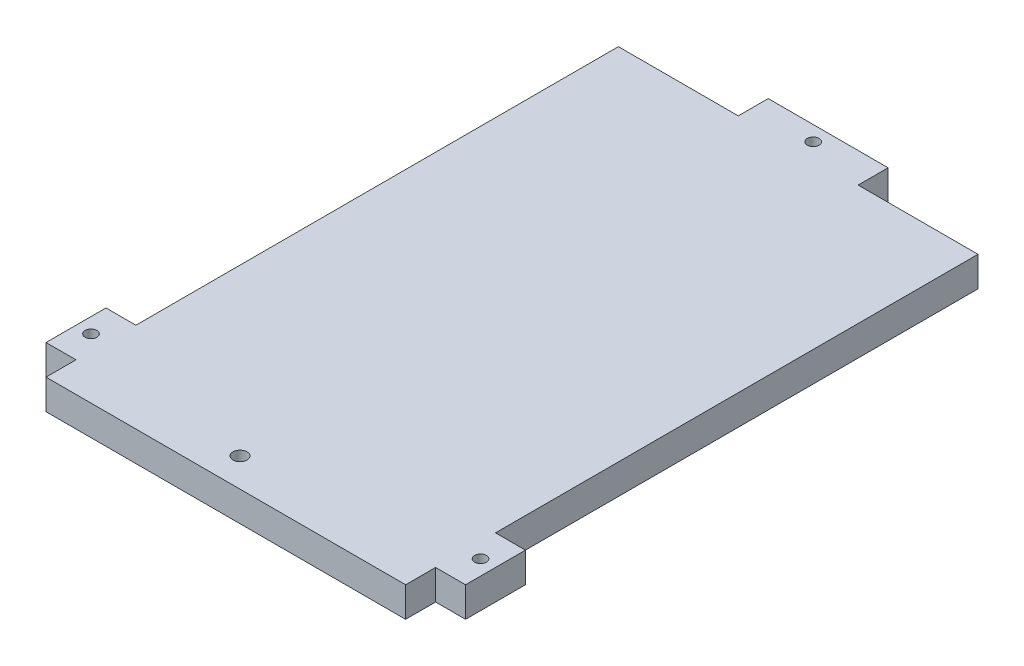
ISO-10303-21;
HEADER;
FILE_DESCRIPTION(('STEP AP214'),'2;1');
FILE_NAME('part.step','',(''),(''),'','','');
FILE_SCHEMA(('AUTOMOTIVE_DESIGN { 1 0 10303 214 1 1 1 1 }'));
ENDSEC;
DATA;
#1=APPLICATION_CONTEXT('core data for automotive mechanical design processes');
#2=APPLICATION_PROTOCOL_DEFINITION('international standard','automotive_design',2000,#1);
#3=PRODUCT_CONTEXT('',#1,'mechanical');
#4=PRODUCT('Part','Part','',(#3));
#5=PRODUCT_RELATED_PRODUCT_CATEGORY('part','',(#4));
#6=PRODUCT_DEFINITION_FORMATION('','',#4);
#7=PRODUCT_DEFINITION_CONTEXT('part definition',#1,'design');
#8=PRODUCT_DEFINITION('design','',#6,#7);
#9=PRODUCT_DEFINITION_SHAPE('','',#8);
#10=(LENGTH_UNIT() NAMED_UNIT(*) SI_UNIT(.MILLI.,.METRE.));
#11=(NAMED_UNIT(*) PLANE_ANGLE_UNIT() SI_UNIT($,.RADIAN.));
#12=(NAMED_UNIT(*) SI_UNIT($,.STERADIAN.) SOLID_ANGLE_UNIT());
#13=UNCERTAINTY_MEASURE_WITH_UNIT(LENGTH_MEASURE(1.E-05),#10,'distance_accuracy_value','');
#14=(GEOMETRIC_REPRESENTATION_CONTEXT(3) GLOBAL_UNCERTAINTY_ASSIGNED_CONTEXT((#13)) GLOBAL_UNIT_ASSIGNED_CONTEXT((#10,
#11,#12)) REPRESENTATION_CONTEXT('',''));
#15=CARTESIAN_POINT('',(0.,0.,0.));
#16=DIRECTION('',(0.,0.,1.));
#17=DIRECTION('',(1.,0.,0.));
#18=AXIS2_PLACEMENT_3D('',#15,#16,#17);
#19=CARTESIAN_POINT('',(0.,6.35,0.));
#20=DIRECTION('',(1.,0.,0.));
#21=DIRECTION('',(0.,0.,-1.));
#22=AXIS2_PLACEMENT_3D('',#19,#20,#21);
#23=PLANE('',#22);
#24=DIRECTION('',(0.,0.,1.));
#25=VECTOR('',#24,1.);
#26=CARTESIAN_POINT('',(0.,0.,0.));
#27=LINE('',#26,#25);
#28=CARTESIAN_POINT('',(0.,0.,-6.35));
#29=VERTEX_POINT('',#28);
#30=CARTESIAN_POINT('',(0.,0.,0.));
#31=VERTEX_POINT('',#30);
#32=EDGE_CURVE('E177',#29,#31,#27,.T.);
#33=ORIENTED_EDGE('',*,*,#32,.T.);
#34=DIRECTION('',(0.,-1.,0.));
#35=VECTOR('',#34,1.);
#36=CARTESIAN_POINT('',(0.,6.35,0.));
#37=LINE('',#36,#35);
#38=CARTESIAN_POINT('',(0.,6.35,0.));
#39=VERTEX_POINT('',#38);
#40=EDGE_CURVE('E11',#39,#31,#37,.T.);
#41=ORIENTED_EDGE('',*,*,#40,.F.);
#42=DIRECTION('',(0.,0.,1.));
#43=VECTOR('',#42,1.);
#44=CARTESIAN_POINT('',(0.,6.35,0.));
#45=LINE('',#44,#43);
#46=CARTESIAN_POINT('',(0.,6.35,-6.35));
#47=VERTEX_POINT('',#46);
#48=EDGE_CURVE('E208',#47,#39,#45,.T.);
#49=ORIENTED_EDGE('',*,*,#48,.F.);
#50=DIRECTION('',(0.,-1.,0.));
#51=VECTOR('',#50,1.);
#52=CARTESIAN_POINT('',(0.,6.35,-6.35));
#53=LINE('',#52,#51);
#54=EDGE_CURVE('E173',#47,#29,#53,.T.);
#55=ORIENTED_EDGE('',*,*,#54,.T.);
#56=EDGE_LOOP('',(#33,#41,#49,#55));
#57=FACE_BOUND('',#56,.T.);
#58=ADVANCED_FACE('F33',(#57),#23,.F.);
#59=CARTESIAN_POINT('',(0.,6.35,0.));
#60=DIRECTION('',(0.,0.,-1.));
#61=DIRECTION('',(-1.,0.,0.));
#62=AXIS2_PLACEMENT_3D('',#59,#60,#61);
#63=PLANE('',#62);
#64=DIRECTION('',(1.,0.,0.));
#65=VECTOR('',#64,1.);
#66=CARTESIAN_POINT('',(0.,0.,0.));
#67=LINE('',#66,#65);
#68=CARTESIAN_POINT('',(76.2,0.,0.));
#69=VERTEX_POINT('',#68);
#70=EDGE_CURVE('E180',#31,#69,#67,.T.);
#71=ORIENTED_EDGE('',*,*,#70,.T.);
#72=DIRECTION('',(0.,-1.,0.));
#73=VECTOR('',#72,1.);
#74=CARTESIAN_POINT('',(76.2,6.35,0.));
#75=LINE('',#74,#73);
#76=CARTESIAN_POINT('',(76.2,6.35,0.));
#77=VERTEX_POINT('',#76);
#78=EDGE_CURVE('E41',#77,#69,#75,.T.);
#79=ORIENTED_EDGE('',*,*,#78,.F.);
#80=DIRECTION('',(1.,0.,0.));
#81=VECTOR('',#80,1.);
#82=CARTESIAN_POINT('',(0.,6.35,0.));
#83=LINE('',#82,#81);
#84=EDGE_CURVE('E116',#39,#77,#83,.T.);
#85=ORIENTED_EDGE('',*,*,#84,.F.);
#86=ORIENTED_EDGE('',*,*,#40,.T.);
#87=EDGE_LOOP('',(#71,#79,#85,#86));
#88=FACE_BOUND('',#87,.T.);
#89=ADVANCED_FACE('F307',(#88),#63,.F.);
#90=CARTESIAN_POINT('',(76.2,6.35,0.));
#91=DIRECTION('',(-1.,0.,0.));
#92=DIRECTION('',(0.,0.,1.));
#93=AXIS2_PLACEMENT_3D('',#90,#91,#92);
#94=PLANE('',#93);
#95=DIRECTION('',(0.,0.,-1.));
#96=VECTOR('',#95,1.);
#97=CARTESIAN_POINT('',(76.2,0.,0.));
#98=LINE('',#97,#96);
#99=CARTESIAN_POINT('',(76.2,0.,-6.35));
#100=VERTEX_POINT('',#99);
#101=EDGE_CURVE('E183',#69,#100,#98,.T.);
#102=ORIENTED_EDGE('',*,*,#101,.T.);
#103=DIRECTION('',(0.,-1.,0.));
#104=VECTOR('',#103,1.);
#105=CARTESIAN_POINT('',(76.2,6.35,-6.35));
#106=LINE('',#105,#104);
#107=CARTESIAN_POINT('',(76.2,6.35,-6.35));
#108=VERTEX_POINT('',#107);
#109=EDGE_CURVE('E239',#108,#100,#106,.T.);
#110=ORIENTED_EDGE('',*,*,#109,.F.);
#111=DIRECTION('',(0.,0.,-1.));
#112=VECTOR('',#111,1.);
#113=CARTESIAN_POINT('',(76.2,6.35,0.));
#114=LINE('',#113,#112);
#115=EDGE_CURVE('E247',#77,#108,#114,.T.);
#116=ORIENTED_EDGE('',*,*,#115,.F.);
#117=ORIENTED_EDGE('',*,*,#78,.T.);
#118=EDGE_LOOP('',(#102,#110,#116,#117));
#119=FACE_BOUND('',#118,.T.);
#120=ADVANCED_FACE('F245',(#119),#94,.F.);
#121=CARTESIAN_POINT('',(76.2,6.35,-6.35));
#122=DIRECTION('',(0.,0.,-1.));
#123=DIRECTION('',(-1.,0.,0.));
#124=AXIS2_PLACEMENT_3D('',#121,#122,#123);
#125=PLANE('',#124);
#126=DIRECTION('',(1.,0.,0.));
#127=VECTOR('',#126,1.);
#128=CARTESIAN_POINT('',(76.2,0.,-6.35));
#129=LINE('',#128,#127);
#130=CARTESIAN_POINT('',(82.55,0.,-6.35));
#131=VERTEX_POINT('',#130);
#132=EDGE_CURVE('E185',#100,#131,#129,.T.);
#133=ORIENTED_EDGE('',*,*,#132,.T.);
#134=DIRECTION('',(0.,-1.,0.));
#135=VECTOR('',#134,1.);
#136=CARTESIAN_POINT('',(82.55,6.35,-6.35));
#137=LINE('',#136,#135);
#138=CARTESIAN_POINT('',(82.55,6.35,-6.35));
#139=VERTEX_POINT('',#138);
#140=EDGE_CURVE('E236',#139,#131,#137,.T.);
#141=ORIENTED_EDGE('',*,*,#140,.F.);
#142=DIRECTION('',(1.,0.,0.));
#143=VECTOR('',#142,1.);
#144=CARTESIAN_POINT('',(76.2,6.35,-6.35));
#145=LINE('',#144,#143);
#146=EDGE_CURVE('E265',#108,#139,#145,.T.);
#147=ORIENTED_EDGE('',*,*,#146,.F.);
#148=ORIENTED_EDGE('',*,*,#109,.T.);
#149=EDGE_LOOP('',(#133,#141,#147,#148));
#150=FACE_BOUND('',#149,.T.);
#151=ADVANCED_FACE('F256',(#150),#125,.F.);
#152=CARTESIAN_POINT('',(82.55,6.35,-19.05));
#153=DIRECTION('',(-1.,0.,0.));
#154=DIRECTION('',(0.,0.,1.));
#155=AXIS2_PLACEMENT_3D('',#152,#153,#154);
#156=PLANE('',#155);
#157=DIRECTION('',(0.,0.,-1.));
#158=VECTOR('',#157,1.);
#159=CARTESIAN_POINT('',(82.55,0.,-19.05));
#160=LINE('',#159,#158);
#161=CARTESIAN_POINT('',(82.55,0.,-19.05));
#162=VERTEX_POINT('',#161);
#163=EDGE_CURVE('E187',#131,#162,#160,.T.);
#164=ORIENTED_EDGE('',*,*,#163,.T.);
#165=DIRECTION('',(0.,-1.,0.));
#166=VECTOR('',#165,1.);
#167=CARTESIAN_POINT('',(82.55,6.35,-19.05));
#168=LINE('',#167,#166);
#169=CARTESIAN_POINT('',(82.55,6.35,-19.05));
#170=VERTEX_POINT('',#169);
#171=EDGE_CURVE('E233',#170,#162,#168,.T.);
#172=ORIENTED_EDGE('',*,*,#171,.F.);
#173=DIRECTION('',(0.,0.,-1.));
#174=VECTOR('',#173,1.);
#175=CARTESIAN_POINT('',(82.55,6.35,-19.05));
#176=LINE('',#175,#174);
#177=EDGE_CURVE('E262',#139,#170,#176,.T.);
#178=ORIENTED_EDGE('',*,*,#177,.F.);
#179=ORIENTED_EDGE('',*,*,#140,.T.);
#180=EDGE_LOOP('',(#164,#172,#178,#179));
#181=FACE_BOUND('',#180,.T.);
#182=ADVANCED_FACE('F260',(#181),#156,.F.);
#183=CARTESIAN_POINT('',(76.2,6.35,-19.05));
#184=DIRECTION('',(0.,0.,1.));
#185=DIRECTION('',(1.,0.,0.));
#186=AXIS2_PLACEMENT_3D('',#183,#184,#185);
#187=PLANE('',#186);
#188=DIRECTION('',(-1.,0.,0.));
#189=VECTOR('',#188,1.);
#190=CARTESIAN_POINT('',(76.2,0.,-19.05));
#191=LINE('',#190,#189);
#192=CARTESIAN_POINT('',(76.2,0.,-19.05));
#193=VERTEX_POINT('',#192);
#194=EDGE_CURVE('E189',#162,#193,#191,.T.);
#195=ORIENTED_EDGE('',*,*,#194,.T.);
#196=DIRECTION('',(0.,-1.,0.));
#197=VECTOR('',#196,1.);
#198=CARTESIAN_POINT('',(76.2,6.35,-19.05));
#199=LINE('',#198,#197);
#200=CARTESIAN_POINT('',(76.2,6.35,-19.05));
#201=VERTEX_POINT('',#200);
#202=EDGE_CURVE('E230',#201,#193,#199,.T.);
#203=ORIENTED_EDGE('',*,*,#202,.F.);
#204=DIRECTION('',(-1.,0.,0.));
#205=VECTOR('',#204,1.);
#206=CARTESIAN_POINT('',(76.2,6.35,-19.05));
#207=LINE('',#206,#205);
#208=EDGE_CURVE('E264',#170,#201,#207,.T.);
#209=ORIENTED_EDGE('',*,*,#208,.F.);
#210=ORIENTED_EDGE('',*,*,#171,.T.);
#211=EDGE_LOOP('',(#195,#203,#209,#210));
#212=FACE_BOUND('',#211,.T.);
#213=ADVANCED_FACE('F320',(#212),#187,.F.);
#214=CARTESIAN_POINT('',(76.2,6.35,-19.05));
#215=DIRECTION('',(-1.,0.,0.));
#216=DIRECTION('',(0.,0.,1.));
#217=AXIS2_PLACEMENT_3D('',#214,#215,#216);
#218=PLANE('',#217);
#219=DIRECTION('',(0.,0.,-1.));
#220=VECTOR('',#219,1.);
#221=CARTESIAN_POINT('',(76.2,0.,-19.05));
#222=LINE('',#221,#220);
#223=CARTESIAN_POINT('',(76.2,0.,-121.285));
#224=VERTEX_POINT('',#223);
#225=EDGE_CURVE('E191',#193,#224,#222,.T.);
#226=ORIENTED_EDGE('',*,*,#225,.T.);
#227=DIRECTION('',(0.,-1.,0.));
#228=VECTOR('',#227,1.);
#229=CARTESIAN_POINT('',(76.2,6.35,-121.285));
#230=LINE('',#229,#228);
#231=CARTESIAN_POINT('',(76.2,6.35,-121.285));
#232=VERTEX_POINT('',#231);
#233=EDGE_CURVE('E227',#232,#224,#230,.T.);
#234=ORIENTED_EDGE('',*,*,#233,.F.);
#235=DIRECTION('',(0.,0.,-1.));
#236=VECTOR('',#235,1.);
#237=CARTESIAN_POINT('',(76.2,6.35,-19.05));
#238=LINE('',#237,#236);
#239=EDGE_CURVE('E267',#201,#232,#238,.T.);
#240=ORIENTED_EDGE('',*,*,#239,.F.);
#241=ORIENTED_EDGE('',*,*,#202,.T.);
#242=EDGE_LOOP('',(#226,#234,#240,#241));
#243=FACE_BOUND('',#242,.T.);
#244=ADVANCED_FACE('F323',(#243),#218,.F.);
#245=CARTESIAN_POINT('',(50.8,6.35,-121.285));
#246=DIRECTION('',(0.,0.,1.));
#247=DIRECTION('',(1.,0.,0.));
#248=AXIS2_PLACEMENT_3D('',#245,#246,#247);
#249=PLANE('',#248);
#250=DIRECTION('',(-1.,0.,0.));
#251=VECTOR('',#250,1.);
#252=CARTESIAN_POINT('',(50.8,0.,-121.285));
#253=LINE('',#252,#251);
#254=CARTESIAN_POINT('',(50.8,0.,-121.285));
#255=VERTEX_POINT('',#254);
#256=EDGE_CURVE('E193',#224,#255,#253,.T.);
#257=ORIENTED_EDGE('',*,*,#256,.T.);
#258=DIRECTION('',(0.,-1.,0.));
#259=VECTOR('',#258,1.);
#260=CARTESIAN_POINT('',(50.8,6.35,-121.285));
#261=LINE('',#260,#259);
#262=CARTESIAN_POINT('',(50.8,6.35,-121.285));
#263=VERTEX_POINT('',#262);
#264=EDGE_CURVE('E224',#263,#255,#261,.T.);
#265=ORIENTED_EDGE('',*,*,#264,.F.);
#266=DIRECTION('',(-1.,0.,0.));
#267=VECTOR('',#266,1.);
#268=CARTESIAN_POINT('',(50.8,6.35,-121.285));
#269=LINE('',#268,#267);
#270=EDGE_CURVE('E273',#232,#263,#269,.T.);
#271=ORIENTED_EDGE('',*,*,#270,.F.);
#272=ORIENTED_EDGE('',*,*,#233,.T.);
#273=EDGE_LOOP('',(#257,#265,#271,#272));
#274=FACE_BOUND('',#273,.T.);
#275=ADVANCED_FACE('F327',(#274),#249,.F.);
#276=CARTESIAN_POINT('',(50.8,6.35,-121.285));
#277=DIRECTION('',(-1.,0.,0.));
#278=DIRECTION('',(0.,0.,1.));
#279=AXIS2_PLACEMENT_3D('',#276,#277,#278);
#280=PLANE('',#279);
#281=DIRECTION('',(0.,0.,-1.));
#282=VECTOR('',#281,1.);
#283=CARTESIAN_POINT('',(50.8,0.,-121.285));
#284=LINE('',#283,#282);
#285=CARTESIAN_POINT('',(50.8,0.,-127.635));
#286=VERTEX_POINT('',#285);
#287=EDGE_CURVE('E195',#255,#286,#284,.T.);
#288=ORIENTED_EDGE('',*,*,#287,.T.);
#289=DIRECTION('',(0.,-1.,0.));
#290=VECTOR('',#289,1.);
#291=CARTESIAN_POINT('',(50.8,6.35,-127.635));
#292=LINE('',#291,#290);
#293=CARTESIAN_POINT('',(50.8,6.35,-127.635));
#294=VERTEX_POINT('',#293);
#295=EDGE_CURVE('E221',#294,#286,#292,.T.);
#296=ORIENTED_EDGE('',*,*,#295,.F.);
#297=DIRECTION('',(0.,0.,-1.));
#298=VECTOR('',#297,1.);
#299=CARTESIAN_POINT('',(50.8,6.35,-121.285));
#300=LINE('',#299,#298);
#301=EDGE_CURVE('E275',#263,#294,#300,.T.);
#302=ORIENTED_EDGE('',*,*,#301,.F.);
#303=ORIENTED_EDGE('',*,*,#264,.T.);
#304=EDGE_LOOP('',(#288,#296,#302,#303));
#305=FACE_BOUND('',#304,.T.);
#306=ADVANCED_FACE('F331',(#305),#280,.F.);
#307=CARTESIAN_POINT('',(25.4,6.35,-127.635));
#308=DIRECTION('',(0.,0.,1.));
#309=DIRECTION('',(1.,0.,0.));
#310=AXIS2_PLACEMENT_3D('',#307,#308,#309);
#311=PLANE('',#310);
#312=DIRECTION('',(-1.,0.,0.));
#313=VECTOR('',#312,1.);
#314=CARTESIAN_POINT('',(25.4,0.,-127.635));
#315=LINE('',#314,#313);
#316=CARTESIAN_POINT('',(25.4,0.,-127.635));
#317=VERTEX_POINT('',#316);
#318=EDGE_CURVE('E197',#286,#317,#315,.T.);
#319=ORIENTED_EDGE('',*,*,#318,.T.);
#320=DIRECTION('',(0.,-1.,0.));
#321=VECTOR('',#320,1.);
#322=CARTESIAN_POINT('',(25.4,6.35,-127.635));
#323=LINE('',#322,#321);
#324=CARTESIAN_POINT('',(25.4,6.35,-127.635));
#325=VERTEX_POINT('',#324);
#326=EDGE_CURVE('E218',#325,#317,#323,.T.);
#327=ORIENTED_EDGE('',*,*,#326,.F.);
#328=DIRECTION('',(-1.,0.,0.));
#329=VECTOR('',#328,1.);
#330=CARTESIAN_POINT('',(25.4,6.35,-127.635));
#331=LINE('',#330,#329);
#332=EDGE_CURVE('E277',#294,#325,#331,.T.);
#333=ORIENTED_EDGE('',*,*,#332,.F.);
#334=ORIENTED_EDGE('',*,*,#295,.T.);
#335=EDGE_LOOP('',(#319,#327,#333,#334));
#336=FACE_BOUND('',#335,.T.);
#337=ADVANCED_FACE('F335',(#336),#311,.F.);
#338=CARTESIAN_POINT('',(25.4,6.35,-121.285));
#339=DIRECTION('',(1.,0.,0.));
#340=DIRECTION('',(0.,0.,-1.));
#341=AXIS2_PLACEMENT_3D('',#338,#339,#340);
#342=PLANE('',#341);
#343=DIRECTION('',(0.,0.,1.));
#344=VECTOR('',#343,1.);
#345=CARTESIAN_POINT('',(25.4,0.,-121.285));
#346=LINE('',#345,#344);
#347=CARTESIAN_POINT('',(25.4,0.,-121.285));
#348=VERTEX_POINT('',#347);
#349=EDGE_CURVE('E199',#317,#348,#346,.T.);
#350=ORIENTED_EDGE('',*,*,#349,.T.);
#351=DIRECTION('',(0.,-1.,0.));
#352=VECTOR('',#351,1.);
#353=CARTESIAN_POINT('',(25.4,6.35,-121.285));
#354=LINE('',#353,#352);
#355=CARTESIAN_POINT('',(25.4,6.35,-121.285));
#356=VERTEX_POINT('',#355);
#357=EDGE_CURVE('E215',#356,#348,#354,.T.);
#358=ORIENTED_EDGE('',*,*,#357,.F.);
#359=DIRECTION('',(0.,0.,1.));
#360=VECTOR('',#359,1.);
#361=CARTESIAN_POINT('',(25.4,6.35,-121.285));
#362=LINE('',#361,#360);
#363=EDGE_CURVE('E279',#325,#356,#362,.T.);
#364=ORIENTED_EDGE('',*,*,#363,.F.);
#365=ORIENTED_EDGE('',*,*,#326,.T.);
#366=EDGE_LOOP('',(#350,#358,#364,#365));
#367=FACE_BOUND('',#366,.T.);
#368=ADVANCED_FACE('F339',(#367),#342,.F.);
#369=CARTESIAN_POINT('',(0.,6.35,-121.285));
#370=DIRECTION('',(0.,0.,1.));
#371=DIRECTION('',(1.,0.,0.));
#372=AXIS2_PLACEMENT_3D('',#369,#370,#371);
#373=PLANE('',#372);
#374=DIRECTION('',(-1.,0.,0.));
#375=VECTOR('',#374,1.);
#376=CARTESIAN_POINT('',(0.,0.,-121.285));
#377=LINE('',#376,#375);
#378=CARTESIAN_POINT('',(0.,0.,-121.285));
#379=VERTEX_POINT('',#378);
#380=EDGE_CURVE('E201',#348,#379,#377,.T.);
#381=ORIENTED_EDGE('',*,*,#380,.T.);
#382=DIRECTION('',(0.,-1.,0.));
#383=VECTOR('',#382,1.);
#384=CARTESIAN_POINT('',(0.,6.35,-121.285));
#385=LINE('',#384,#383);
#386=CARTESIAN_POINT('',(0.,6.35,-121.285));
#387=VERTEX_POINT('',#386);
#388=EDGE_CURVE('E212',#387,#379,#385,.T.);
#389=ORIENTED_EDGE('',*,*,#388,.F.);
#390=DIRECTION('',(-1.,0.,0.));
#391=VECTOR('',#390,1.);
#392=CARTESIAN_POINT('',(0.,6.35,-121.285));
#393=LINE('',#392,#391);
#394=EDGE_CURVE('E281',#356,#387,#393,.T.);
#395=ORIENTED_EDGE('',*,*,#394,.F.);
#396=ORIENTED_EDGE('',*,*,#357,.T.);
#397=EDGE_LOOP('',(#381,#389,#395,#396));
#398=FACE_BOUND('',#397,.T.);
#399=ADVANCED_FACE('F287',(#398),#373,.F.);
#400=CARTESIAN_POINT('',(0.,6.35,-19.05));
#401=DIRECTION('',(1.,0.,0.));
#402=DIRECTION('',(0.,0.,-1.));
#403=AXIS2_PLACEMENT_3D('',#400,#401,#402);
#404=PLANE('',#403);
#405=DIRECTION('',(0.,0.,1.));
#406=VECTOR('',#405,1.);
#407=CARTESIAN_POINT('',(0.,0.,-19.05));
#408=LINE('',#407,#406);
#409=CARTESIAN_POINT('',(0.,0.,-19.05));
#410=VERTEX_POINT('',#409);
#411=EDGE_CURVE('E203',#379,#410,#408,.T.);
#412=ORIENTED_EDGE('',*,*,#411,.T.);
#413=DIRECTION('',(0.,-1.,0.));
#414=VECTOR('',#413,1.);
#415=CARTESIAN_POINT('',(0.,6.35,-19.05));
#416=LINE('',#415,#414);
#417=CARTESIAN_POINT('',(0.,6.35,-19.05));
#418=VERTEX_POINT('',#417);
#419=EDGE_CURVE('E168',#418,#410,#416,.T.);
#420=ORIENTED_EDGE('',*,*,#419,.F.);
#421=DIRECTION('',(0.,0.,1.));
#422=VECTOR('',#421,1.);
#423=CARTESIAN_POINT('',(0.,6.35,-19.05));
#424=LINE('',#423,#422);
#425=EDGE_CURVE('E159',#387,#418,#424,.T.);
#426=ORIENTED_EDGE('',*,*,#425,.F.);
#427=ORIENTED_EDGE('',*,*,#388,.T.);
#428=EDGE_LOOP('',(#412,#420,#426,#427));
#429=FACE_BOUND('',#428,.T.);
#430=ADVANCED_FACE('F291',(#429),#404,.F.);
#431=CARTESIAN_POINT('',(0.,6.35,-19.05));
#432=DIRECTION('',(0.,0.,1.));
#433=DIRECTION('',(1.,0.,0.));
#434=AXIS2_PLACEMENT_3D('',#431,#432,#433);
#435=PLANE('',#434);
#436=DIRECTION('',(-1.,0.,0.));
#437=VECTOR('',#436,1.);
#438=CARTESIAN_POINT('',(0.,0.,-19.05));
#439=LINE('',#438,#437);
#440=CARTESIAN_POINT('',(-6.35,0.,-19.05));
#441=VERTEX_POINT('',#440);
#442=EDGE_CURVE('E167',#410,#441,#439,.T.);
#443=ORIENTED_EDGE('',*,*,#442,.T.);
#444=DIRECTION('',(0.,-1.,0.));
#445=VECTOR('',#444,1.);
#446=CARTESIAN_POINT('',(-6.35,6.35,-19.05));
#447=LINE('',#446,#445);
#448=CARTESIAN_POINT('',(-6.35,6.35,-19.05));
#449=VERTEX_POINT('',#448);
#450=EDGE_CURVE('E164',#449,#441,#447,.T.);
#451=ORIENTED_EDGE('',*,*,#450,.F.);
#452=DIRECTION('',(-1.,0.,0.));
#453=VECTOR('',#452,1.);
#454=CARTESIAN_POINT('',(0.,6.35,-19.05));
#455=LINE('',#454,#453);
#456=EDGE_CURVE('E153',#418,#449,#455,.T.);
#457=ORIENTED_EDGE('',*,*,#456,.F.);
#458=ORIENTED_EDGE('',*,*,#419,.T.);
#459=EDGE_LOOP('',(#443,#451,#457,#458));
#460=FACE_BOUND('',#459,.T.);
#461=ADVANCED_FACE('F165',(#460),#435,.F.);
#462=CARTESIAN_POINT('',(-6.35,6.35,-19.05));
#463=DIRECTION('',(1.,0.,0.));
#464=DIRECTION('',(0.,0.,-1.));
#465=AXIS2_PLACEMENT_3D('',#462,#463,#464);
#466=PLANE('',#465);
#467=DIRECTION('',(0.,0.,1.));
#468=VECTOR('',#467,1.);
#469=CARTESIAN_POINT('',(-6.35,0.,-19.05));
#470=LINE('',#469,#468);
#471=CARTESIAN_POINT('',(-6.35,0.,-6.35));
#472=VERTEX_POINT('',#471);
#473=EDGE_CURVE('E102',#441,#472,#470,.T.);
#474=ORIENTED_EDGE('',*,*,#473,.T.);
#475=DIRECTION('',(0.,-1.,0.));
#476=VECTOR('',#475,1.);
#477=CARTESIAN_POINT('',(-6.35,6.35,-6.35));
#478=LINE('',#477,#476);
#479=CARTESIAN_POINT('',(-6.35,6.35,-6.35));
#480=VERTEX_POINT('',#479);
#481=EDGE_CURVE('E169',#480,#472,#478,.T.);
#482=ORIENTED_EDGE('',*,*,#481,.F.);
#483=DIRECTION('',(0.,0.,1.));
#484=VECTOR('',#483,1.);
#485=CARTESIAN_POINT('',(-6.35,6.35,-19.05));
#486=LINE('',#485,#484);
#487=EDGE_CURVE('E157',#449,#480,#486,.T.);
#488=ORIENTED_EDGE('',*,*,#487,.F.);
#489=ORIENTED_EDGE('',*,*,#450,.T.);
#490=EDGE_LOOP('',(#474,#482,#488,#489));
#491=FACE_BOUND('',#490,.T.);
#492=ADVANCED_FACE('F171',(#491),#466,.F.);
#493=CARTESIAN_POINT('',(0.,6.35,-6.35));
#494=DIRECTION('',(0.,0.,-1.));
#495=DIRECTION('',(-1.,0.,0.));
#496=AXIS2_PLACEMENT_3D('',#493,#494,#495);
#497=PLANE('',#496);
#498=DIRECTION('',(1.,0.,0.));
#499=VECTOR('',#498,1.);
#500=CARTESIAN_POINT('',(0.,0.,-6.35));
#501=LINE('',#500,#499);
#502=EDGE_CURVE('E108',#472,#29,#501,.T.);
#503=ORIENTED_EDGE('',*,*,#502,.T.);
#504=ORIENTED_EDGE('',*,*,#54,.F.);
#505=DIRECTION('',(1.,0.,0.));
#506=VECTOR('',#505,1.);
#507=CARTESIAN_POINT('',(0.,6.35,-6.35));
#508=LINE('',#507,#506);
#509=EDGE_CURVE('E49',#480,#47,#508,.T.);
#510=ORIENTED_EDGE('',*,*,#509,.F.);
#511=ORIENTED_EDGE('',*,*,#481,.T.);
#512=EDGE_LOOP('',(#503,#504,#510,#511));
#513=FACE_BOUND('',#512,.T.);
#514=ADVANCED_FACE('F295',(#513),#497,.F.);
#515=CARTESIAN_POINT('',(0.,6.35,0.));
#516=DIRECTION('',(0.,1.,0.));
#517=DIRECTION('',(0.,0.,1.));
#518=AXIS2_PLACEMENT_3D('',#515,#516,#517);
#519=PLANE('',#518);
#520=CARTESIAN_POINT('',(38.1,6.35,-124.46));
#521=DIRECTION('',(0.,1.,0.));
#522=DIRECTION('',(0.,0.,1.));
#523=AXIS2_PLACEMENT_3D('',#520,#521,#522);
#524=CIRCLE('',#523,1.25);
#525=CARTESIAN_POINT('',(38.1,6.35,-123.21));
#526=VERTEX_POINT('',#525);
#527=EDGE_CURVE('E425',#526,#526,#524,.T.);
#528=ORIENTED_EDGE('',*,*,#527,.F.);
#529=EDGE_LOOP('',(#528));
#530=FACE_BOUND('',#529,.T.);
#531=CARTESIAN_POINT('',(79.375,6.35,-12.7));
#532=DIRECTION('',(0.,1.,0.));
#533=DIRECTION('',(0.,0.,1.));
#534=AXIS2_PLACEMENT_3D('',#531,#532,#533);
#535=CIRCLE('',#534,1.25);
#536=CARTESIAN_POINT('',(79.375,6.35,-11.45));
#537=VERTEX_POINT('',#536);
#538=EDGE_CURVE('E427',#537,#537,#535,.T.);
#539=ORIENTED_EDGE('',*,*,#538,.F.);
#540=EDGE_LOOP('',(#539));
#541=FACE_BOUND('',#540,.T.);
#542=CARTESIAN_POINT('',(-3.175,6.35,-12.7));
#543=DIRECTION('',(0.,1.,0.));
#544=DIRECTION('',(0.,0.,1.));
#545=AXIS2_PLACEMENT_3D('',#542,#543,#544);
#546=CIRCLE('',#545,1.25);
#547=CARTESIAN_POINT('',(-3.175,6.35,-11.45));
#548=VERTEX_POINT('',#547);
#549=EDGE_CURVE('E433',#548,#548,#546,.T.);
#550=ORIENTED_EDGE('',*,*,#549,.F.);
#551=EDGE_LOOP('',(#550));
#552=FACE_BOUND('',#551,.T.);
#553=CARTESIAN_POINT('',(35.0139,6.35,-6.09599999999999));
#554=DIRECTION('',(0.,1.,0.));
#555=DIRECTION('',(0.,0.,1.));
#556=AXIS2_PLACEMENT_3D('',#553,#554,#555);
#557=CIRCLE('',#556,1.5);
#558=CARTESIAN_POINT('',(35.0139,6.35,-4.59599999999999));
#559=VERTEX_POINT('',#558);
#560=EDGE_CURVE('E439',#559,#559,#557,.T.);
#561=ORIENTED_EDGE('',*,*,#560,.F.);
#562=EDGE_LOOP('',(#561));
#563=FACE_BOUND('',#562,.T.);
#564=ORIENTED_EDGE('',*,*,#48,.T.);
#565=ORIENTED_EDGE('',*,*,#84,.T.);
#566=ORIENTED_EDGE('',*,*,#115,.T.);
#567=ORIENTED_EDGE('',*,*,#146,.T.);
#568=ORIENTED_EDGE('',*,*,#177,.T.);
#569=ORIENTED_EDGE('',*,*,#208,.T.);
#570=ORIENTED_EDGE('',*,*,#239,.T.);
#571=ORIENTED_EDGE('',*,*,#270,.T.);
#572=ORIENTED_EDGE('',*,*,#301,.T.);
#573=ORIENTED_EDGE('',*,*,#332,.T.);
#574=ORIENTED_EDGE('',*,*,#363,.T.);
#575=ORIENTED_EDGE('',*,*,#394,.T.);
#576=ORIENTED_EDGE('',*,*,#425,.T.);
#577=ORIENTED_EDGE('',*,*,#456,.T.);
#578=ORIENTED_EDGE('',*,*,#487,.T.);
#579=ORIENTED_EDGE('',*,*,#509,.T.);
#580=EDGE_LOOP('',(#564,#565,#566,#567,#568,#569,#570,#571,#572,#573,#574,#575,#576,#577,#578,#579));
#581=FACE_BOUND('',#580,.T.);
#582=ADVANCED_FACE('F155',(#530,#541,#552,#563,#581),#519,.T.);
#583=CARTESIAN_POINT('',(0.,0.,0.));
#584=DIRECTION('',(0.,1.,0.));
#585=DIRECTION('',(0.,0.,1.));
#586=AXIS2_PLACEMENT_3D('',#583,#584,#585);
#587=PLANE('',#586);
#588=CARTESIAN_POINT('',(38.1,0.,-124.46));
#589=DIRECTION('',(0.,1.,0.));
#590=DIRECTION('',(0.,0.,1.));
#591=AXIS2_PLACEMENT_3D('',#588,#589,#590);
#592=CIRCLE('',#591,1.25);
#593=CARTESIAN_POINT('',(38.1,0.,-123.21));
#594=VERTEX_POINT('',#593);
#595=EDGE_CURVE('E422',#594,#594,#592,.T.);
#596=ORIENTED_EDGE('',*,*,#595,.T.);
#597=EDGE_LOOP('',(#596));
#598=FACE_BOUND('',#597,.T.);
#599=CARTESIAN_POINT('',(79.375,0.,-12.7));
#600=DIRECTION('',(0.,1.,0.));
#601=DIRECTION('',(0.,0.,1.));
#602=AXIS2_PLACEMENT_3D('',#599,#600,#601);
#603=CIRCLE('',#602,1.25);
#604=CARTESIAN_POINT('',(79.375,0.,-11.45));
#605=VERTEX_POINT('',#604);
#606=EDGE_CURVE('E430',#605,#605,#603,.T.);
#607=ORIENTED_EDGE('',*,*,#606,.T.);
#608=EDGE_LOOP('',(#607));
#609=FACE_BOUND('',#608,.T.);
#610=CARTESIAN_POINT('',(-3.175,0.,-12.7));
#611=DIRECTION('',(0.,1.,0.));
#612=DIRECTION('',(0.,0.,1.));
#613=AXIS2_PLACEMENT_3D('',#610,#611,#612);
#614=CIRCLE('',#613,1.25);
#615=CARTESIAN_POINT('',(-3.175,0.,-11.45));
#616=VERTEX_POINT('',#615);
#617=EDGE_CURVE('E436',#616,#616,#614,.T.);
#618=ORIENTED_EDGE('',*,*,#617,.T.);
#619=EDGE_LOOP('',(#618));
#620=FACE_BOUND('',#619,.T.);
#621=CARTESIAN_POINT('',(35.0139,0.,-6.09599999999999));
#622=DIRECTION('',(0.,1.,0.));
#623=DIRECTION('',(0.,0.,1.));
#624=AXIS2_PLACEMENT_3D('',#621,#622,#623);
#625=CIRCLE('',#624,1.5);
#626=CARTESIAN_POINT('',(35.0139,0.,-4.59599999999999));
#627=VERTEX_POINT('',#626);
#628=EDGE_CURVE('E181',#627,#627,#625,.T.);
#629=ORIENTED_EDGE('',*,*,#628,.T.);
#630=EDGE_LOOP('',(#629));
#631=FACE_BOUND('',#630,.T.);
#632=ORIENTED_EDGE('',*,*,#32,.F.);
#633=ORIENTED_EDGE('',*,*,#502,.F.);
#634=ORIENTED_EDGE('',*,*,#473,.F.);
#635=ORIENTED_EDGE('',*,*,#442,.F.);
#636=ORIENTED_EDGE('',*,*,#411,.F.);
#637=ORIENTED_EDGE('',*,*,#380,.F.);
#638=ORIENTED_EDGE('',*,*,#349,.F.);
#639=ORIENTED_EDGE('',*,*,#318,.F.);
#640=ORIENTED_EDGE('',*,*,#287,.F.);
#641=ORIENTED_EDGE('',*,*,#256,.F.);
#642=ORIENTED_EDGE('',*,*,#225,.F.);
#643=ORIENTED_EDGE('',*,*,#194,.F.);
#644=ORIENTED_EDGE('',*,*,#163,.F.);
#645=ORIENTED_EDGE('',*,*,#132,.F.);
#646=ORIENTED_EDGE('',*,*,#101,.F.);
#647=ORIENTED_EDGE('',*,*,#70,.F.);
#648=EDGE_LOOP('',(#632,#633,#634,#635,#636,#637,#638,#639,#640,#641,#642,#643,#644,#645,#646,#647));
#649=FACE_BOUND('',#648,.T.);
#650=ADVANCED_FACE('F251',(#598,#609,#620,#631,#649),#587,.F.);
#651=CARTESIAN_POINT('',(35.0139,0.,-6.09599999999999));
#652=DIRECTION('',(0.,1.,0.));
#653=DIRECTION('',(0.,0.,1.));
#654=AXIS2_PLACEMENT_3D('',#651,#652,#653);
#655=CYLINDRICAL_SURFACE('',#654,1.5);
#656=ORIENTED_EDGE('',*,*,#628,.F.);
#657=EDGE_LOOP('',(#656));
#658=FACE_BOUND('',#657,.T.);
#659=ORIENTED_EDGE('',*,*,#560,.T.);
#660=EDGE_LOOP('',(#659));
#661=FACE_BOUND('',#660,.T.);
#662=ADVANCED_FACE('F367',(#658,#661),#655,.F.);
#663=CARTESIAN_POINT('',(-3.175,0.,-12.7));
#664=DIRECTION('',(0.,1.,0.));
#665=DIRECTION('',(0.,0.,1.));
#666=AXIS2_PLACEMENT_3D('',#663,#664,#665);
#667=CYLINDRICAL_SURFACE('',#666,1.25);
#668=ORIENTED_EDGE('',*,*,#617,.F.);
#669=EDGE_LOOP('',(#668));
#670=FACE_BOUND('',#669,.T.);
#671=ORIENTED_EDGE('',*,*,#549,.T.);
#672=EDGE_LOOP('',(#671));
#673=FACE_BOUND('',#672,.T.);
#674=ADVANCED_FACE('F372',(#670,#673),#667,.F.);
#675=CARTESIAN_POINT('',(79.375,0.,-12.7));
#676=DIRECTION('',(0.,1.,0.));
#677=DIRECTION('',(0.,0.,1.));
#678=AXIS2_PLACEMENT_3D('',#675,#676,#677);
#679=CYLINDRICAL_SURFACE('',#678,1.25);
#680=ORIENTED_EDGE('',*,*,#606,.F.);
#681=EDGE_LOOP('',(#680));
#682=FACE_BOUND('',#681,.T.);
#683=ORIENTED_EDGE('',*,*,#538,.T.);
#684=EDGE_LOOP('',(#683));
#685=FACE_BOUND('',#684,.T.);
#686=ADVANCED_FACE('F395',(#682,#685),#679,.F.);
#687=CARTESIAN_POINT('',(38.1,0.,-124.46));
#688=DIRECTION('',(0.,1.,0.));
#689=DIRECTION('',(0.,0.,1.));
#690=AXIS2_PLACEMENT_3D('',#687,#688,#689);
#691=CYLINDRICAL_SURFACE('',#690,1.25);
#692=ORIENTED_EDGE('',*,*,#595,.F.);
#693=EDGE_LOOP('',(#692));
#694=FACE_BOUND('',#693,.T.);
#695=ORIENTED_EDGE('',*,*,#527,.T.);
#696=EDGE_LOOP('',(#695));
#697=FACE_BOUND('',#696,.T.);
#698=ADVANCED_FACE('F405',(#694,#697),#691,.F.);
#699=CLOSED_SHELL('',(#58,#89,#120,#151,#182,#213,#244,#275,#306,#337,#368,#399,#430,#461,#492,
#514,#582,#650,#662,#674,#686,#698));
#700=MANIFOLD_SOLID_BREP('B2',#699);
#701=ADVANCED_BREP_SHAPE_REPRESENTATION('',(#18,#700),#14);
#702=SHAPE_DEFINITION_REPRESENTATION(#9,#701);
ENDSEC;
END-ISO-10303-21;
